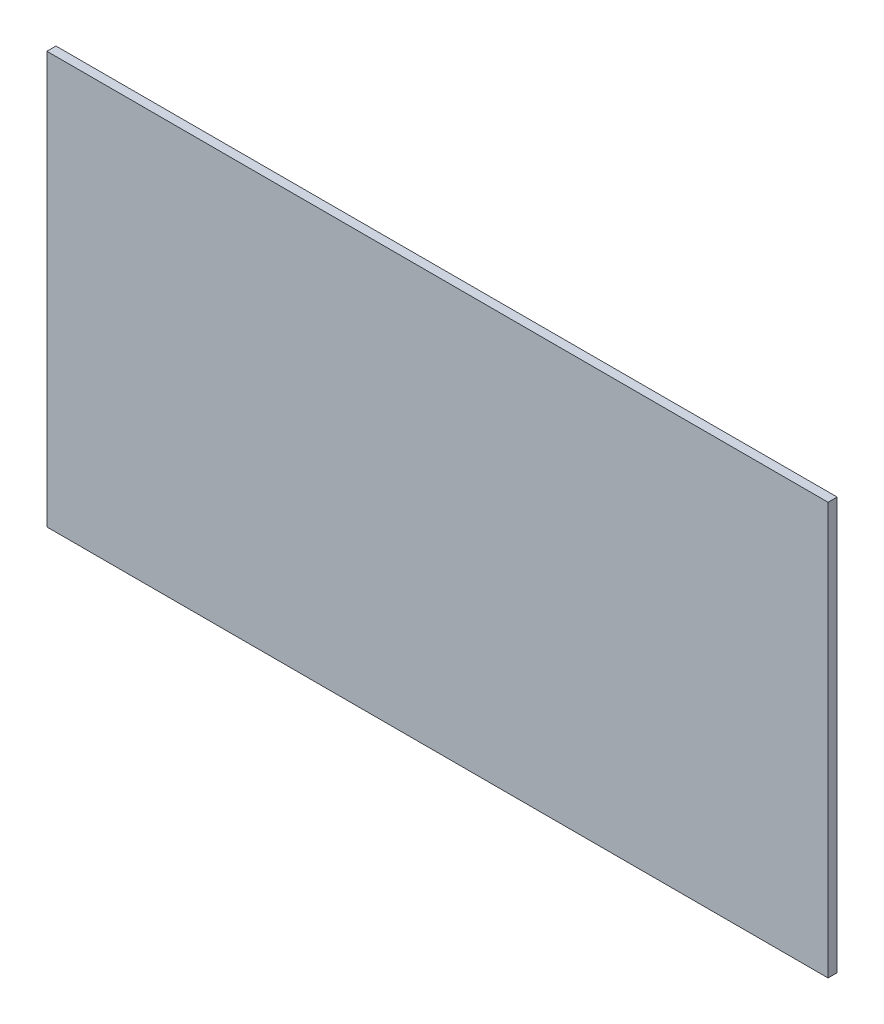
ISO-10303-21;
HEADER;
FILE_DESCRIPTION(('STEP AP214'),'2;1');
FILE_NAME('part.step','',(''),(''),'','','');
FILE_SCHEMA(('AUTOMOTIVE_DESIGN { 1 0 10303 214 1 1 1 1 }'));
ENDSEC;
DATA;
#1=APPLICATION_CONTEXT('core data for automotive mechanical design processes');
#2=APPLICATION_PROTOCOL_DEFINITION('international standard','automotive_design',2000,#1);
#3=PRODUCT_CONTEXT('',#1,'mechanical');
#4=PRODUCT('Part','Part','',(#3));
#5=PRODUCT_RELATED_PRODUCT_CATEGORY('part','',(#4));
#6=PRODUCT_DEFINITION_FORMATION('','',#4);
#7=PRODUCT_DEFINITION_CONTEXT('part definition',#1,'design');
#8=PRODUCT_DEFINITION('design','',#6,#7);
#9=PRODUCT_DEFINITION_SHAPE('','',#8);
#10=(LENGTH_UNIT() NAMED_UNIT(*) SI_UNIT(.MILLI.,.METRE.));
#11=(NAMED_UNIT(*) PLANE_ANGLE_UNIT() SI_UNIT($,.RADIAN.));
#12=(NAMED_UNIT(*) SI_UNIT($,.STERADIAN.) SOLID_ANGLE_UNIT());
#13=UNCERTAINTY_MEASURE_WITH_UNIT(LENGTH_MEASURE(1.E-05),#10,'distance_accuracy_value','');
#14=(GEOMETRIC_REPRESENTATION_CONTEXT(3) GLOBAL_UNCERTAINTY_ASSIGNED_CONTEXT((#13)) GLOBAL_UNIT_ASSIGNED_CONTEXT((#10,
#11,#12)) REPRESENTATION_CONTEXT('',''));
#15=CARTESIAN_POINT('',(0.,0.,0.));
#16=DIRECTION('',(0.,0.,1.));
#17=DIRECTION('',(1.,0.,0.));
#18=AXIS2_PLACEMENT_3D('',#15,#16,#17);
#19=CARTESIAN_POINT('',(0.,0.,-2.65684));
#20=DIRECTION('',(-1.,0.,0.));
#21=DIRECTION('',(0.,0.,1.));
#22=AXIS2_PLACEMENT_3D('',#19,#20,#21);
#23=PLANE('',#22);
#24=DIRECTION('',(0.,-1.,0.));
#25=VECTOR('',#24,1.);
#26=CARTESIAN_POINT('',(0.,0.,0.));
#27=LINE('',#26,#25);
#28=CARTESIAN_POINT('',(0.,120.88368,0.));
#29=VERTEX_POINT('',#28);
#30=CARTESIAN_POINT('',(0.,0.,0.));
#31=VERTEX_POINT('',#30);
#32=EDGE_CURVE('E104',#29,#31,#27,.T.);
#33=ORIENTED_EDGE('',*,*,#32,.F.);
#34=DIRECTION('',(0.,0.,1.));
#35=VECTOR('',#34,1.);
#36=CARTESIAN_POINT('',(0.,120.88368,-2.65684));
#37=LINE('',#36,#35);
#38=CARTESIAN_POINT('',(0.,120.88368,-2.65684));
#39=VERTEX_POINT('',#38);
#40=EDGE_CURVE('E11',#39,#29,#37,.T.);
#41=ORIENTED_EDGE('',*,*,#40,.F.);
#42=DIRECTION('',(0.,-1.,0.));
#43=VECTOR('',#42,1.);
#44=CARTESIAN_POINT('',(0.,0.,-2.65684));
#45=LINE('',#44,#43);
#46=CARTESIAN_POINT('',(0.,0.,-2.65684));
#47=VERTEX_POINT('',#46);
#48=EDGE_CURVE('E98',#39,#47,#45,.T.);
#49=ORIENTED_EDGE('',*,*,#48,.T.);
#50=DIRECTION('',(0.,0.,1.));
#51=VECTOR('',#50,1.);
#52=CARTESIAN_POINT('',(0.,0.,-2.65684));
#53=LINE('',#52,#51);
#54=EDGE_CURVE('E43',#47,#31,#53,.T.);
#55=ORIENTED_EDGE('',*,*,#54,.T.);
#56=EDGE_LOOP('',(#33,#41,#49,#55));
#57=FACE_BOUND('',#56,.T.);
#58=ADVANCED_FACE('F40',(#57),#23,.T.);
#59=CARTESIAN_POINT('',(0.,120.88368,-2.65684));
#60=DIRECTION('',(0.,1.,0.));
#61=DIRECTION('',(0.,0.,1.));
#62=AXIS2_PLACEMENT_3D('',#59,#60,#61);
#63=PLANE('',#62);
#64=DIRECTION('',(-1.,0.,0.));
#65=VECTOR('',#64,1.);
#66=CARTESIAN_POINT('',(0.,120.88368,0.));
#67=LINE('',#66,#65);
#68=CARTESIAN_POINT('',(229.1969,120.88368,0.));
#69=VERTEX_POINT('',#68);
#70=EDGE_CURVE('E100',#69,#29,#67,.T.);
#71=ORIENTED_EDGE('',*,*,#70,.F.);
#72=DIRECTION('',(0.,0.,1.));
#73=VECTOR('',#72,1.);
#74=CARTESIAN_POINT('',(229.1969,120.88368,-2.65684));
#75=LINE('',#74,#73);
#76=CARTESIAN_POINT('',(229.1969,120.88368,-2.65684));
#77=VERTEX_POINT('',#76);
#78=EDGE_CURVE('E49',#77,#69,#75,.T.);
#79=ORIENTED_EDGE('',*,*,#78,.F.);
#80=DIRECTION('',(-1.,0.,0.));
#81=VECTOR('',#80,1.);
#82=CARTESIAN_POINT('',(0.,120.88368,-2.65684));
#83=LINE('',#82,#81);
#84=EDGE_CURVE('E95',#77,#39,#83,.T.);
#85=ORIENTED_EDGE('',*,*,#84,.T.);
#86=ORIENTED_EDGE('',*,*,#40,.T.);
#87=EDGE_LOOP('',(#71,#79,#85,#86));
#88=FACE_BOUND('',#87,.T.);
#89=ADVANCED_FACE('F114',(#88),#63,.T.);
#90=CARTESIAN_POINT('',(229.1969,0.,-2.65684));
#91=DIRECTION('',(1.,0.,0.));
#92=DIRECTION('',(0.,0.,-1.));
#93=AXIS2_PLACEMENT_3D('',#90,#91,#92);
#94=PLANE('',#93);
#95=DIRECTION('',(0.,1.,0.));
#96=VECTOR('',#95,1.);
#97=CARTESIAN_POINT('',(229.1969,0.,0.));
#98=LINE('',#97,#96);
#99=CARTESIAN_POINT('',(229.1969,0.,0.));
#100=VERTEX_POINT('',#99);
#101=EDGE_CURVE('E90',#100,#69,#98,.T.);
#102=ORIENTED_EDGE('',*,*,#101,.F.);
#103=DIRECTION('',(0.,0.,1.));
#104=VECTOR('',#103,1.);
#105=CARTESIAN_POINT('',(229.1969,0.,-2.65684));
#106=LINE('',#105,#104);
#107=CARTESIAN_POINT('',(229.1969,0.,-2.65684));
#108=VERTEX_POINT('',#107);
#109=EDGE_CURVE('E85',#108,#100,#106,.T.);
#110=ORIENTED_EDGE('',*,*,#109,.F.);
#111=DIRECTION('',(0.,1.,0.));
#112=VECTOR('',#111,1.);
#113=CARTESIAN_POINT('',(229.1969,0.,-2.65684));
#114=LINE('',#113,#112);
#115=EDGE_CURVE('E88',#108,#77,#114,.T.);
#116=ORIENTED_EDGE('',*,*,#115,.T.);
#117=ORIENTED_EDGE('',*,*,#78,.T.);
#118=EDGE_LOOP('',(#102,#110,#116,#117));
#119=FACE_BOUND('',#118,.T.);
#120=ADVANCED_FACE('F87',(#119),#94,.T.);
#121=CARTESIAN_POINT('',(0.,0.,-2.65684));
#122=DIRECTION('',(0.,-1.,0.));
#123=DIRECTION('',(0.,0.,-1.));
#124=AXIS2_PLACEMENT_3D('',#121,#122,#123);
#125=PLANE('',#124);
#126=DIRECTION('',(1.,0.,0.));
#127=VECTOR('',#126,1.);
#128=CARTESIAN_POINT('',(0.,0.,0.));
#129=LINE('',#128,#127);
#130=EDGE_CURVE('E107',#31,#100,#129,.T.);
#131=ORIENTED_EDGE('',*,*,#130,.F.);
#132=ORIENTED_EDGE('',*,*,#54,.F.);
#133=DIRECTION('',(1.,0.,0.));
#134=VECTOR('',#133,1.);
#135=CARTESIAN_POINT('',(0.,0.,-2.65684));
#136=LINE('',#135,#134);
#137=EDGE_CURVE('E94',#47,#108,#136,.T.);
#138=ORIENTED_EDGE('',*,*,#137,.T.);
#139=ORIENTED_EDGE('',*,*,#109,.T.);
#140=EDGE_LOOP('',(#131,#132,#138,#139));
#141=FACE_BOUND('',#140,.T.);
#142=ADVANCED_FACE('F97',(#141),#125,.T.);
#143=CARTESIAN_POINT('',(0.,0.,-2.65684));
#144=DIRECTION('',(0.,0.,-1.));
#145=DIRECTION('',(-1.,0.,0.));
#146=AXIS2_PLACEMENT_3D('',#143,#144,#145);
#147=PLANE('',#146);
#148=ORIENTED_EDGE('',*,*,#48,.F.);
#149=ORIENTED_EDGE('',*,*,#84,.F.);
#150=ORIENTED_EDGE('',*,*,#115,.F.);
#151=ORIENTED_EDGE('',*,*,#137,.F.);
#152=EDGE_LOOP('',(#148,#149,#150,#151));
#153=FACE_BOUND('',#152,.T.);
#154=ADVANCED_FACE('F93',(#153),#147,.T.);
#155=CARTESIAN_POINT('',(0.,0.,0.));
#156=DIRECTION('',(0.,0.,-1.));
#157=DIRECTION('',(-1.,0.,0.));
#158=AXIS2_PLACEMENT_3D('',#155,#156,#157);
#159=PLANE('',#158);
#160=ORIENTED_EDGE('',*,*,#32,.T.);
#161=ORIENTED_EDGE('',*,*,#130,.T.);
#162=ORIENTED_EDGE('',*,*,#101,.T.);
#163=ORIENTED_EDGE('',*,*,#70,.T.);
#164=EDGE_LOOP('',(#160,#161,#162,#163));
#165=FACE_BOUND('',#164,.T.);
#166=ADVANCED_FACE('F113',(#165),#159,.F.);
#167=CLOSED_SHELL('',(#58,#89,#120,#142,#154,#166));
#168=MANIFOLD_SOLID_BREP('B2',#167);
#169=ADVANCED_BREP_SHAPE_REPRESENTATION('',(#18,#168),#14);
#170=SHAPE_DEFINITION_REPRESENTATION(#9,#169);
ENDSEC;
END-ISO-10303-21;
